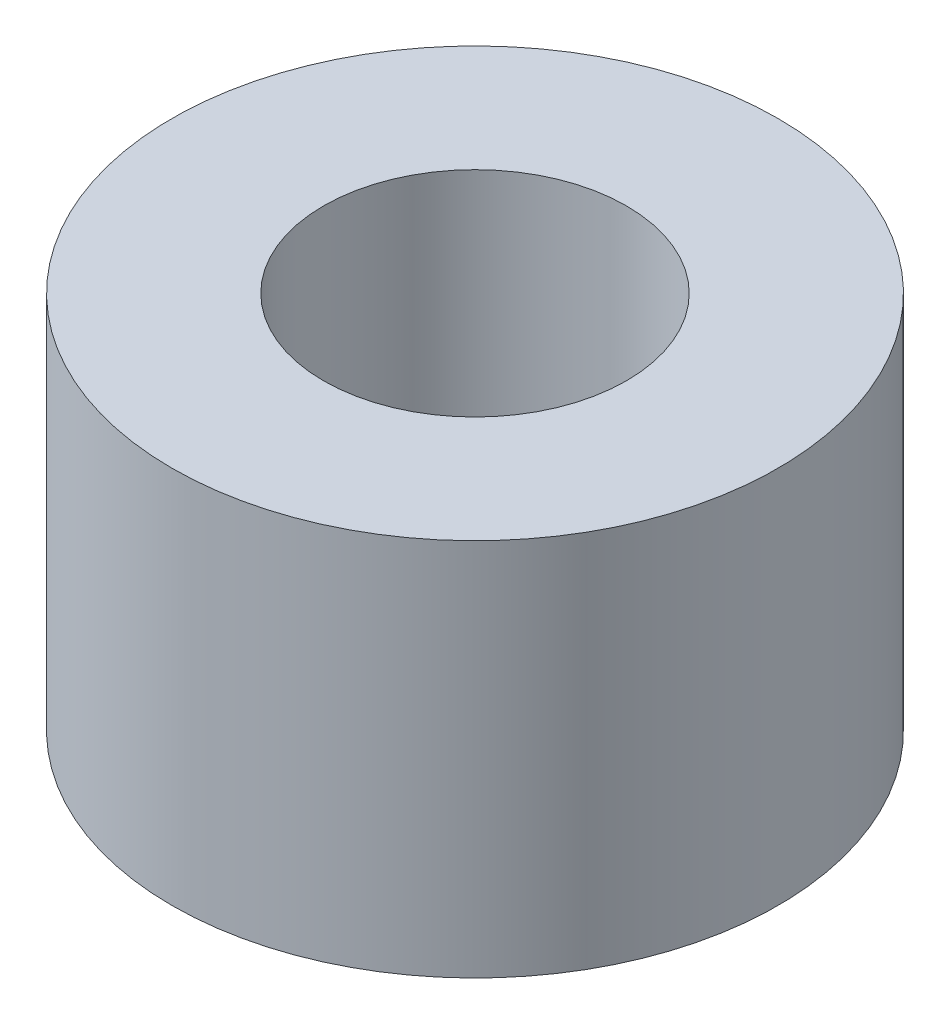
ISO-10303-21;
HEADER;
FILE_DESCRIPTION(('STEP AP214'),'2;1');
FILE_NAME('part.step','',(''),(''),'','','');
FILE_SCHEMA(('AUTOMOTIVE_DESIGN { 1 0 10303 214 1 1 1 1 }'));
ENDSEC;
DATA;
#1=APPLICATION_CONTEXT('core data for automotive mechanical design processes');
#2=APPLICATION_PROTOCOL_DEFINITION('international standard','automotive_design',2000,#1);
#3=PRODUCT_CONTEXT('',#1,'mechanical');
#4=PRODUCT('Part','Part','',(#3));
#5=PRODUCT_RELATED_PRODUCT_CATEGORY('part','',(#4));
#6=PRODUCT_DEFINITION_FORMATION('','',#4);
#7=PRODUCT_DEFINITION_CONTEXT('part definition',#1,'design');
#8=PRODUCT_DEFINITION('design','',#6,#7);
#9=PRODUCT_DEFINITION_SHAPE('','',#8);
#10=(LENGTH_UNIT() NAMED_UNIT(*) SI_UNIT(.MILLI.,.METRE.));
#11=(NAMED_UNIT(*) PLANE_ANGLE_UNIT() SI_UNIT($,.RADIAN.));
#12=(NAMED_UNIT(*) SI_UNIT($,.STERADIAN.) SOLID_ANGLE_UNIT());
#13=UNCERTAINTY_MEASURE_WITH_UNIT(LENGTH_MEASURE(1.E-05),#10,'distance_accuracy_value','');
#14=(GEOMETRIC_REPRESENTATION_CONTEXT(3) GLOBAL_UNCERTAINTY_ASSIGNED_CONTEXT((#13)) GLOBAL_UNIT_ASSIGNED_CONTEXT((#10,
#11,#12)) REPRESENTATION_CONTEXT('',''));
#15=CARTESIAN_POINT('',(0.,0.,0.));
#16=DIRECTION('',(0.,0.,1.));
#17=DIRECTION('',(1.,0.,0.));
#18=AXIS2_PLACEMENT_3D('',#15,#16,#17);
#19=CARTESIAN_POINT('',(0.,5.,0.));
#20=DIRECTION('',(0.,1.,0.));
#21=DIRECTION('',(0.,0.,1.));
#22=AXIS2_PLACEMENT_3D('',#19,#20,#21);
#23=PLANE('',#22);
#24=CARTESIAN_POINT('',(0.,5.,0.));
#25=DIRECTION('',(0.,1.,0.));
#26=DIRECTION('',(0.,0.,1.));
#27=AXIS2_PLACEMENT_3D('',#24,#25,#26);
#28=CIRCLE('',#27,4.);
#29=CARTESIAN_POINT('',(0.,5.,4.));
#30=VERTEX_POINT('',#29);
#31=EDGE_CURVE('E10',#30,#30,#28,.T.);
#32=ORIENTED_EDGE('',*,*,#31,.T.);
#33=EDGE_LOOP('',(#32));
#34=FACE_BOUND('',#33,.T.);
#35=CARTESIAN_POINT('',(0.,5.,0.));
#36=DIRECTION('',(0.,1.,0.));
#37=DIRECTION('',(0.,0.,1.));
#38=AXIS2_PLACEMENT_3D('',#35,#36,#37);
#39=CIRCLE('',#38,2.);
#40=CARTESIAN_POINT('',(0.,5.,2.));
#41=VERTEX_POINT('',#40);
#42=EDGE_CURVE('E45',#41,#41,#39,.T.);
#43=ORIENTED_EDGE('',*,*,#42,.F.);
#44=EDGE_LOOP('',(#43));
#45=FACE_BOUND('',#44,.T.);
#46=ADVANCED_FACE('F34',(#34,#45),#23,.T.);
#47=CARTESIAN_POINT('',(0.,0.,0.));
#48=DIRECTION('',(0.,1.,0.));
#49=DIRECTION('',(0.,0.,1.));
#50=AXIS2_PLACEMENT_3D('',#47,#48,#49);
#51=PLANE('',#50);
#52=CARTESIAN_POINT('',(0.,0.,0.));
#53=DIRECTION('',(0.,1.,0.));
#54=DIRECTION('',(0.,0.,1.));
#55=AXIS2_PLACEMENT_3D('',#52,#53,#54);
#56=CIRCLE('',#55,4.);
#57=CARTESIAN_POINT('',(0.,0.,4.));
#58=VERTEX_POINT('',#57);
#59=EDGE_CURVE('E38',#58,#58,#56,.T.);
#60=ORIENTED_EDGE('',*,*,#59,.F.);
#61=EDGE_LOOP('',(#60));
#62=FACE_BOUND('',#61,.T.);
#63=CARTESIAN_POINT('',(0.,0.,0.));
#64=DIRECTION('',(0.,1.,0.));
#65=DIRECTION('',(0.,0.,1.));
#66=AXIS2_PLACEMENT_3D('',#63,#64,#65);
#67=CIRCLE('',#66,2.);
#68=CARTESIAN_POINT('',(0.,0.,2.));
#69=VERTEX_POINT('',#68);
#70=EDGE_CURVE('E47',#69,#69,#67,.T.);
#71=ORIENTED_EDGE('',*,*,#70,.T.);
#72=EDGE_LOOP('',(#71));
#73=FACE_BOUND('',#72,.T.);
#74=ADVANCED_FACE('F57',(#62,#73),#51,.F.);
#75=CARTESIAN_POINT('',(0.,5.,0.));
#76=DIRECTION('',(0.,-1.,0.));
#77=DIRECTION('',(0.,0.,-1.));
#78=AXIS2_PLACEMENT_3D('',#75,#76,#77);
#79=CYLINDRICAL_SURFACE('',#78,4.);
#80=ORIENTED_EDGE('',*,*,#31,.F.);
#81=EDGE_LOOP('',(#80));
#82=FACE_BOUND('',#81,.T.);
#83=ORIENTED_EDGE('',*,*,#59,.T.);
#84=EDGE_LOOP('',(#83));
#85=FACE_BOUND('',#84,.T.);
#86=ADVANCED_FACE('F36',(#82,#85),#79,.T.);
#87=CARTESIAN_POINT('',(0.,5.,0.));
#88=DIRECTION('',(0.,-1.,0.));
#89=DIRECTION('',(0.,0.,-1.));
#90=AXIS2_PLACEMENT_3D('',#87,#88,#89);
#91=CYLINDRICAL_SURFACE('',#90,2.);
#92=ORIENTED_EDGE('',*,*,#42,.T.);
#93=EDGE_LOOP('',(#92));
#94=FACE_BOUND('',#93,.T.);
#95=ORIENTED_EDGE('',*,*,#70,.F.);
#96=EDGE_LOOP('',(#95));
#97=FACE_BOUND('',#96,.T.);
#98=ADVANCED_FACE('F53',(#94,#97),#91,.F.);
#99=CLOSED_SHELL('',(#46,#74,#86,#98));
#100=MANIFOLD_SOLID_BREP('B2',#99);
#101=ADVANCED_BREP_SHAPE_REPRESENTATION('',(#18,#100),#14);
#102=SHAPE_DEFINITION_REPRESENTATION(#9,#101);
ENDSEC;
END-ISO-10303-21;
